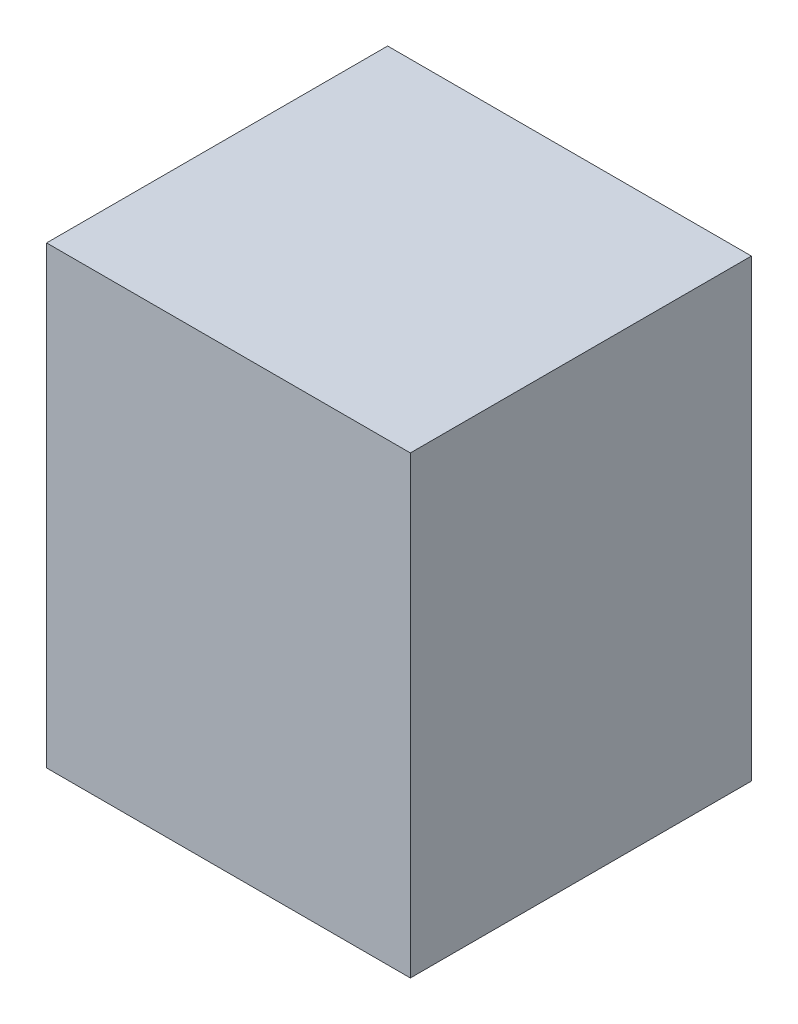
ISO-10303-21;
HEADER;
FILE_DESCRIPTION(('STEP AP214'),'2;1');
FILE_NAME('part.step','',(''),(''),'','','');
FILE_SCHEMA(('AUTOMOTIVE_DESIGN { 1 0 10303 214 1 1 1 1 }'));
ENDSEC;
DATA;
#1=APPLICATION_CONTEXT('core data for automotive mechanical design processes');
#2=APPLICATION_PROTOCOL_DEFINITION('international standard','automotive_design',2000,#1);
#3=PRODUCT_CONTEXT('',#1,'mechanical');
#4=PRODUCT('Part','Part','',(#3));
#5=PRODUCT_RELATED_PRODUCT_CATEGORY('part','',(#4));
#6=PRODUCT_DEFINITION_FORMATION('','',#4);
#7=PRODUCT_DEFINITION_CONTEXT('part definition',#1,'design');
#8=PRODUCT_DEFINITION('design','',#6,#7);
#9=PRODUCT_DEFINITION_SHAPE('','',#8);
#10=(LENGTH_UNIT() NAMED_UNIT(*) SI_UNIT(.MILLI.,.METRE.));
#11=(NAMED_UNIT(*) PLANE_ANGLE_UNIT() SI_UNIT($,.RADIAN.));
#12=(NAMED_UNIT(*) SI_UNIT($,.STERADIAN.) SOLID_ANGLE_UNIT());
#13=UNCERTAINTY_MEASURE_WITH_UNIT(LENGTH_MEASURE(1.E-05),#10,'distance_accuracy_value','');
#14=(GEOMETRIC_REPRESENTATION_CONTEXT(3) GLOBAL_UNCERTAINTY_ASSIGNED_CONTEXT((#13)) GLOBAL_UNIT_ASSIGNED_CONTEXT((#10,
#11,#12)) REPRESENTATION_CONTEXT('',''));
#15=CARTESIAN_POINT('',(0.,0.,0.));
#16=DIRECTION('',(0.,0.,1.));
#17=DIRECTION('',(1.,0.,0.));
#18=AXIS2_PLACEMENT_3D('',#15,#16,#17);
#19=CARTESIAN_POINT('',(0.40000174,0.50000154,0.75000104));
#20=DIRECTION('',(0.,0.,-1.));
#21=DIRECTION('',(-1.,0.,0.));
#22=AXIS2_PLACEMENT_3D('',#19,#20,#21);
#23=PLANE('',#22);
#24=DIRECTION('',(0.,1.,0.));
#25=VECTOR('',#24,1.);
#26=CARTESIAN_POINT('',(-0.3999992,0.50000154,0.75000104));
#27=LINE('',#26,#25);
#28=CARTESIAN_POINT('',(-0.3999992,0.50000154,0.75000104));
#29=VERTEX_POINT('',#28);
#30=CARTESIAN_POINT('',(-0.3999992,-0.499999,0.75000104));
#31=VERTEX_POINT('',#30);
#32=EDGE_CURVE('E55',#29,#31,#27,.F.);
#33=ORIENTED_EDGE('',*,*,#32,.T.);
#34=DIRECTION('',(1.,0.,0.));
#35=VECTOR('',#34,1.);
#36=CARTESIAN_POINT('',(-0.3999992,-0.499999,0.75000104));
#37=LINE('',#36,#35);
#38=CARTESIAN_POINT('',(0.40000174,-0.499999,0.75000104));
#39=VERTEX_POINT('',#38);
#40=EDGE_CURVE('E57',#31,#39,#37,.T.);
#41=ORIENTED_EDGE('',*,*,#40,.T.);
#42=DIRECTION('',(0.,1.,0.));
#43=VECTOR('',#42,1.);
#44=CARTESIAN_POINT('',(0.40000174,-0.499999,0.75000104));
#45=LINE('',#44,#43);
#46=CARTESIAN_POINT('',(0.40000174,0.50000154,0.75000104));
#47=VERTEX_POINT('',#46);
#48=EDGE_CURVE('E20',#39,#47,#45,.T.);
#49=ORIENTED_EDGE('',*,*,#48,.T.);
#50=DIRECTION('',(1.,0.,0.));
#51=VECTOR('',#50,1.);
#52=CARTESIAN_POINT('',(0.40000174,0.50000154,0.75000104));
#53=LINE('',#52,#51);
#54=EDGE_CURVE('E80',#47,#29,#53,.F.);
#55=ORIENTED_EDGE('',*,*,#54,.T.);
#56=EDGE_LOOP('',(#33,#41,#49,#55));
#57=FACE_BOUND('',#56,.T.);
#58=ADVANCED_FACE('F17',(#57),#23,.F.);
#59=CARTESIAN_POINT('',(0.40000174,-0.499999,0.));
#60=DIRECTION('',(-1.,0.,0.));
#61=DIRECTION('',(0.,0.,1.));
#62=AXIS2_PLACEMENT_3D('',#59,#60,#61);
#63=PLANE('',#62);
#64=DIRECTION('',(0.,0.,-1.));
#65=VECTOR('',#64,1.);
#66=CARTESIAN_POINT('',(0.40000174,0.50000154,0.));
#67=LINE('',#66,#65);
#68=CARTESIAN_POINT('',(0.40000174,0.50000154,0.));
#69=VERTEX_POINT('',#68);
#70=EDGE_CURVE('E68',#69,#47,#67,.F.);
#71=ORIENTED_EDGE('',*,*,#70,.T.);
#72=ORIENTED_EDGE('',*,*,#48,.F.);
#73=DIRECTION('',(0.,0.,1.));
#74=VECTOR('',#73,1.);
#75=CARTESIAN_POINT('',(0.40000174,-0.499999,0.));
#76=LINE('',#75,#74);
#77=CARTESIAN_POINT('',(0.40000174,-0.499999,0.));
#78=VERTEX_POINT('',#77);
#79=EDGE_CURVE('E63',#39,#78,#76,.F.);
#80=ORIENTED_EDGE('',*,*,#79,.T.);
#81=DIRECTION('',(0.,1.,0.));
#82=VECTOR('',#81,1.);
#83=CARTESIAN_POINT('',(0.40000174,0.50000154,0.));
#84=LINE('',#83,#82);
#85=EDGE_CURVE('E83',#69,#78,#84,.F.);
#86=ORIENTED_EDGE('',*,*,#85,.F.);
#87=EDGE_LOOP('',(#71,#72,#80,#86));
#88=FACE_BOUND('',#87,.T.);
#89=ADVANCED_FACE('F65',(#88),#63,.F.);
#90=CARTESIAN_POINT('',(-0.3999992,-0.499999,0.));
#91=DIRECTION('',(0.,1.,0.));
#92=DIRECTION('',(0.,0.,1.));
#93=AXIS2_PLACEMENT_3D('',#90,#91,#92);
#94=PLANE('',#93);
#95=ORIENTED_EDGE('',*,*,#79,.F.);
#96=ORIENTED_EDGE('',*,*,#40,.F.);
#97=DIRECTION('',(0.,0.,-1.));
#98=VECTOR('',#97,1.);
#99=CARTESIAN_POINT('',(-0.3999992,-0.499999,0.));
#100=LINE('',#99,#98);
#101=CARTESIAN_POINT('',(-0.3999992,-0.499999,0.));
#102=VERTEX_POINT('',#101);
#103=EDGE_CURVE('E75',#31,#102,#100,.T.);
#104=ORIENTED_EDGE('',*,*,#103,.T.);
#105=DIRECTION('',(-1.,0.,0.));
#106=VECTOR('',#105,1.);
#107=CARTESIAN_POINT('',(0.40000174,-0.499999,0.));
#108=LINE('',#107,#106);
#109=EDGE_CURVE('E72',#78,#102,#108,.T.);
#110=ORIENTED_EDGE('',*,*,#109,.F.);
#111=EDGE_LOOP('',(#95,#96,#104,#110));
#112=FACE_BOUND('',#111,.T.);
#113=ADVANCED_FACE('F70',(#112),#94,.F.);
#114=CARTESIAN_POINT('',(-0.3999992,0.50000154,0.));
#115=DIRECTION('',(1.,0.,0.));
#116=DIRECTION('',(0.,0.,-1.));
#117=AXIS2_PLACEMENT_3D('',#114,#115,#116);
#118=PLANE('',#117);
#119=ORIENTED_EDGE('',*,*,#103,.F.);
#120=ORIENTED_EDGE('',*,*,#32,.F.);
#121=DIRECTION('',(0.,0.,-1.));
#122=VECTOR('',#121,1.);
#123=CARTESIAN_POINT('',(-0.3999992,0.50000154,0.));
#124=LINE('',#123,#122);
#125=CARTESIAN_POINT('',(-0.3999992,0.50000154,0.));
#126=VERTEX_POINT('',#125);
#127=EDGE_CURVE('E35',#29,#126,#124,.T.);
#128=ORIENTED_EDGE('',*,*,#127,.T.);
#129=DIRECTION('',(0.,1.,0.));
#130=VECTOR('',#129,1.);
#131=CARTESIAN_POINT('',(-0.3999992,0.50000154,0.));
#132=LINE('',#131,#130);
#133=EDGE_CURVE('E26',#102,#126,#132,.T.);
#134=ORIENTED_EDGE('',*,*,#133,.F.);
#135=EDGE_LOOP('',(#119,#120,#128,#134));
#136=FACE_BOUND('',#135,.T.);
#137=ADVANCED_FACE('F89',(#136),#118,.F.);
#138=CARTESIAN_POINT('',(0.40000174,0.50000154,0.));
#139=DIRECTION('',(0.,-1.,0.));
#140=DIRECTION('',(0.,0.,-1.));
#141=AXIS2_PLACEMENT_3D('',#138,#139,#140);
#142=PLANE('',#141);
#143=ORIENTED_EDGE('',*,*,#127,.F.);
#144=ORIENTED_EDGE('',*,*,#54,.F.);
#145=ORIENTED_EDGE('',*,*,#70,.F.);
#146=DIRECTION('',(-1.,0.,0.));
#147=VECTOR('',#146,1.);
#148=CARTESIAN_POINT('',(0.40000174,0.50000154,0.));
#149=LINE('',#148,#147);
#150=EDGE_CURVE('E11',#126,#69,#149,.F.);
#151=ORIENTED_EDGE('',*,*,#150,.F.);
#152=EDGE_LOOP('',(#143,#144,#145,#151));
#153=FACE_BOUND('',#152,.T.);
#154=ADVANCED_FACE('F91',(#153),#142,.F.);
#155=CARTESIAN_POINT('',(0.40000174,0.50000154,0.));
#156=DIRECTION('',(0.,0.,-1.));
#157=DIRECTION('',(-1.,0.,0.));
#158=AXIS2_PLACEMENT_3D('',#155,#156,#157);
#159=PLANE('',#158);
#160=ORIENTED_EDGE('',*,*,#133,.T.);
#161=ORIENTED_EDGE('',*,*,#150,.T.);
#162=ORIENTED_EDGE('',*,*,#85,.T.);
#163=ORIENTED_EDGE('',*,*,#109,.T.);
#164=EDGE_LOOP('',(#160,#161,#162,#163));
#165=FACE_BOUND('',#164,.T.);
#166=ADVANCED_FACE('F88',(#165),#159,.T.);
#167=CLOSED_SHELL('',(#58,#89,#113,#137,#154,#166));
#168=MANIFOLD_SOLID_BREP('B1',#167);
#169=ADVANCED_BREP_SHAPE_REPRESENTATION('',(#18,#168),#14);
#170=SHAPE_DEFINITION_REPRESENTATION(#9,#169);
ENDSEC;
END-ISO-10303-21;
